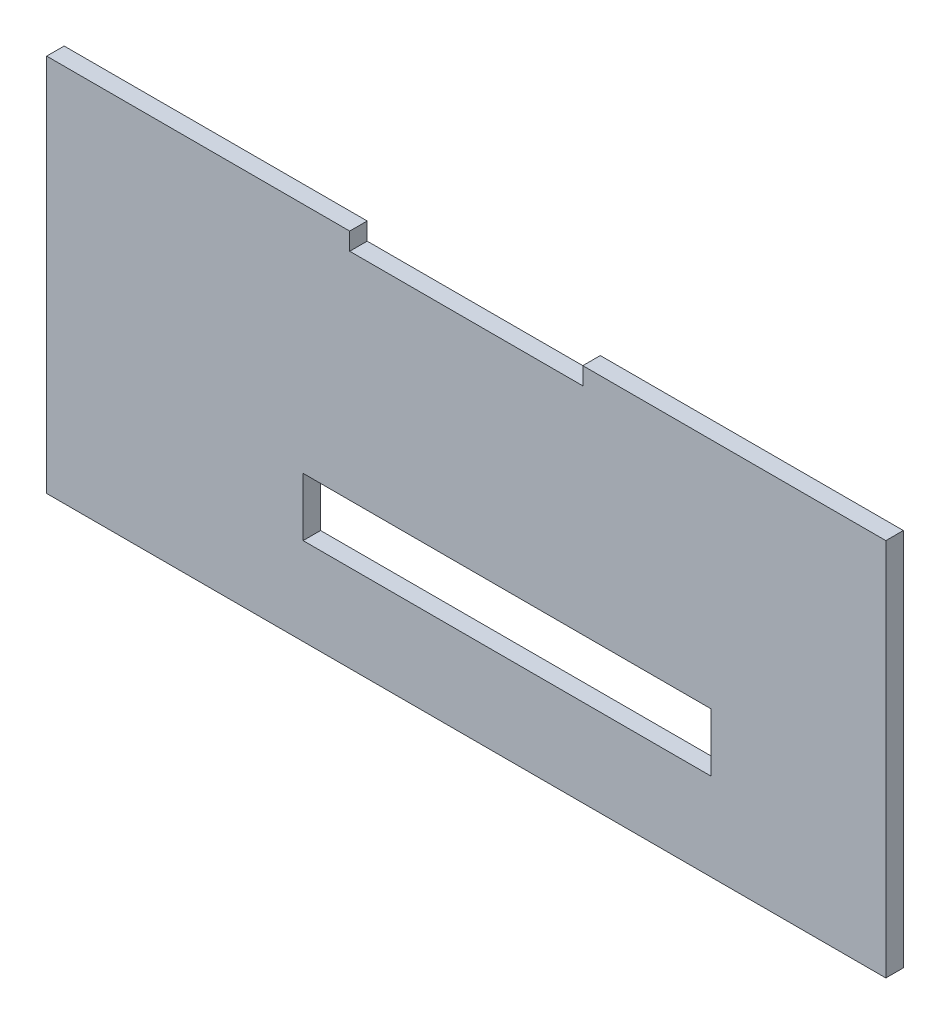
ISO-10303-21;
HEADER;
FILE_DESCRIPTION(('STEP AP214'),'2;1');
FILE_NAME('part.step','',(''),(''),'','','');
FILE_SCHEMA(('AUTOMOTIVE_DESIGN { 1 0 10303 214 1 1 1 1 }'));
ENDSEC;
DATA;
#1=APPLICATION_CONTEXT('core data for automotive mechanical design processes');
#2=APPLICATION_PROTOCOL_DEFINITION('international standard','automotive_design',2000,#1);
#3=PRODUCT_CONTEXT('',#1,'mechanical');
#4=PRODUCT('Part','Part','',(#3));
#5=PRODUCT_RELATED_PRODUCT_CATEGORY('part','',(#4));
#6=PRODUCT_DEFINITION_FORMATION('','',#4);
#7=PRODUCT_DEFINITION_CONTEXT('part definition',#1,'design');
#8=PRODUCT_DEFINITION('design','',#6,#7);
#9=PRODUCT_DEFINITION_SHAPE('','',#8);
#10=(LENGTH_UNIT() NAMED_UNIT(*) SI_UNIT(.MILLI.,.METRE.));
#11=(NAMED_UNIT(*) PLANE_ANGLE_UNIT() SI_UNIT($,.RADIAN.));
#12=(NAMED_UNIT(*) SI_UNIT($,.STERADIAN.) SOLID_ANGLE_UNIT());
#13=UNCERTAINTY_MEASURE_WITH_UNIT(LENGTH_MEASURE(1.E-05),#10,'distance_accuracy_value','');
#14=(GEOMETRIC_REPRESENTATION_CONTEXT(3) GLOBAL_UNCERTAINTY_ASSIGNED_CONTEXT((#13)) GLOBAL_UNIT_ASSIGNED_CONTEXT((#10,
#11,#12)) REPRESENTATION_CONTEXT('',''));
#15=CARTESIAN_POINT('',(0.,0.,0.));
#16=DIRECTION('',(0.,0.,1.));
#17=DIRECTION('',(1.,0.,0.));
#18=AXIS2_PLACEMENT_3D('',#15,#16,#17);
#19=CARTESIAN_POINT('',(0.,37.2829010171101,1.));
#20=DIRECTION('',(0.,1.,0.));
#21=DIRECTION('',(0.,0.,1.));
#22=AXIS2_PLACEMENT_3D('',#19,#20,#21);
#23=PLANE('',#22);
#24=DIRECTION('',(0.,0.,-1.));
#25=VECTOR('',#24,1.);
#26=CARTESIAN_POINT('',(23.7135698266103,37.2829010171101,1.));
#27=LINE('',#26,#25);
#28=CARTESIAN_POINT('',(23.7135698266103,37.2829010171101,1.));
#29=VERTEX_POINT('',#28);
#30=CARTESIAN_POINT('',(23.7135698266103,37.2829010171101,-2.));
#31=VERTEX_POINT('',#30);
#32=EDGE_CURVE('E57',#29,#31,#27,.T.);
#33=ORIENTED_EDGE('',*,*,#32,.T.);
#34=DIRECTION('',(1.,0.,0.));
#35=VECTOR('',#34,1.);
#36=CARTESIAN_POINT('',(0.,37.2829010171101,-2.));
#37=LINE('',#36,#35);
#38=CARTESIAN_POINT('',(-28.2864301733897,37.2829010171101,-2.));
#39=VERTEX_POINT('',#38);
#40=EDGE_CURVE('E164',#39,#31,#37,.T.);
#41=ORIENTED_EDGE('',*,*,#40,.F.);
#42=DIRECTION('',(0.,0.,-1.));
#43=VECTOR('',#42,1.);
#44=CARTESIAN_POINT('',(-28.2864301733897,37.2829010171101,1.));
#45=LINE('',#44,#43);
#46=CARTESIAN_POINT('',(-28.2864301733897,37.2829010171101,1.));
#47=VERTEX_POINT('',#46);
#48=EDGE_CURVE('E11',#47,#39,#45,.T.);
#49=ORIENTED_EDGE('',*,*,#48,.F.);
#50=DIRECTION('',(1.,0.,0.));
#51=VECTOR('',#50,1.);
#52=CARTESIAN_POINT('',(0.,37.2829010171101,1.));
#53=LINE('',#52,#51);
#54=EDGE_CURVE('E206',#47,#29,#53,.T.);
#55=ORIENTED_EDGE('',*,*,#54,.T.);
#56=EDGE_LOOP('',(#33,#41,#49,#55));
#57=FACE_BOUND('',#56,.T.);
#58=ADVANCED_FACE('F39',(#57),#23,.T.);
#59=CARTESIAN_POINT('',(-28.2864301733897,0.,1.));
#60=DIRECTION('',(1.,0.,0.));
#61=DIRECTION('',(0.,0.,-1.));
#62=AXIS2_PLACEMENT_3D('',#59,#60,#61);
#63=PLANE('',#62);
#64=ORIENTED_EDGE('',*,*,#48,.T.);
#65=DIRECTION('',(0.,-1.,0.));
#66=VECTOR('',#65,1.);
#67=CARTESIAN_POINT('',(-28.2864301733897,0.,-2.));
#68=LINE('',#67,#66);
#69=CARTESIAN_POINT('',(-28.2864301733897,34.2829010171101,-2.));
#70=VERTEX_POINT('',#69);
#71=EDGE_CURVE('E168',#39,#70,#68,.T.);
#72=ORIENTED_EDGE('',*,*,#71,.T.);
#73=DIRECTION('',(0.,0.,-1.));
#74=VECTOR('',#73,1.);
#75=CARTESIAN_POINT('',(-28.2864301733897,34.2829010171101,1.));
#76=LINE('',#75,#74);
#77=CARTESIAN_POINT('',(-28.2864301733897,34.2829010171101,1.));
#78=VERTEX_POINT('',#77);
#79=EDGE_CURVE('E49',#78,#70,#76,.T.);
#80=ORIENTED_EDGE('',*,*,#79,.F.);
#81=DIRECTION('',(0.,-1.,0.));
#82=VECTOR('',#81,1.);
#83=CARTESIAN_POINT('',(-28.2864301733897,0.,1.));
#84=LINE('',#83,#82);
#85=EDGE_CURVE('E209',#47,#78,#84,.T.);
#86=ORIENTED_EDGE('',*,*,#85,.F.);
#87=EDGE_LOOP('',(#64,#72,#80,#86));
#88=FACE_BOUND('',#87,.T.);
#89=ADVANCED_FACE('F272',(#88),#63,.F.);
#90=CARTESIAN_POINT('',(0.,34.2829010171101,1.));
#91=DIRECTION('',(0.,1.,0.));
#92=DIRECTION('',(0.,0.,1.));
#93=AXIS2_PLACEMENT_3D('',#90,#91,#92);
#94=PLANE('',#93);
#95=ORIENTED_EDGE('',*,*,#79,.T.);
#96=DIRECTION('',(1.,0.,0.));
#97=VECTOR('',#96,1.);
#98=CARTESIAN_POINT('',(0.,34.2829010171101,-2.));
#99=LINE('',#98,#97);
#100=CARTESIAN_POINT('',(-68.2864301733897,34.2829010171101,-2.));
#101=VERTEX_POINT('',#100);
#102=EDGE_CURVE('E173',#101,#70,#99,.T.);
#103=ORIENTED_EDGE('',*,*,#102,.F.);
#104=DIRECTION('',(0.,0.,-1.));
#105=VECTOR('',#104,1.);
#106=CARTESIAN_POINT('',(-68.2864301733897,34.2829010171101,1.));
#107=LINE('',#106,#105);
#108=CARTESIAN_POINT('',(-68.2864301733897,34.2829010171101,1.));
#109=VERTEX_POINT('',#108);
#110=EDGE_CURVE('E243',#109,#101,#107,.T.);
#111=ORIENTED_EDGE('',*,*,#110,.F.);
#112=DIRECTION('',(1.,0.,0.));
#113=VECTOR('',#112,1.);
#114=CARTESIAN_POINT('',(0.,34.2829010171101,1.));
#115=LINE('',#114,#113);
#116=EDGE_CURVE('E213',#109,#78,#115,.T.);
#117=ORIENTED_EDGE('',*,*,#116,.T.);
#118=EDGE_LOOP('',(#95,#103,#111,#117));
#119=FACE_BOUND('',#118,.T.);
#120=ADVANCED_FACE('F279',(#119),#94,.T.);
#121=CARTESIAN_POINT('',(-68.2864301733897,0.,1.));
#122=DIRECTION('',(1.,0.,0.));
#123=DIRECTION('',(0.,0.,-1.));
#124=AXIS2_PLACEMENT_3D('',#121,#122,#123);
#125=PLANE('',#124);
#126=ORIENTED_EDGE('',*,*,#110,.T.);
#127=DIRECTION('',(0.,-1.,0.));
#128=VECTOR('',#127,1.);
#129=CARTESIAN_POINT('',(-68.2864301733897,0.,-2.));
#130=LINE('',#129,#128);
#131=CARTESIAN_POINT('',(-68.2864301733897,37.2829010171101,-2.));
#132=VERTEX_POINT('',#131);
#133=EDGE_CURVE('E177',#132,#101,#130,.T.);
#134=ORIENTED_EDGE('',*,*,#133,.F.);
#135=DIRECTION('',(0.,0.,-1.));
#136=VECTOR('',#135,1.);
#137=CARTESIAN_POINT('',(-68.2864301733897,37.2829010171101,1.));
#138=LINE('',#137,#136);
#139=CARTESIAN_POINT('',(-68.2864301733897,37.2829010171101,1.));
#140=VERTEX_POINT('',#139);
#141=EDGE_CURVE('E240',#140,#132,#138,.T.);
#142=ORIENTED_EDGE('',*,*,#141,.F.);
#143=DIRECTION('',(0.,-1.,0.));
#144=VECTOR('',#143,1.);
#145=CARTESIAN_POINT('',(-68.2864301733897,0.,1.));
#146=LINE('',#145,#144);
#147=EDGE_CURVE('E217',#140,#109,#146,.T.);
#148=ORIENTED_EDGE('',*,*,#147,.T.);
#149=EDGE_LOOP('',(#126,#134,#142,#148));
#150=FACE_BOUND('',#149,.T.);
#151=ADVANCED_FACE('F285',(#150),#125,.T.);
#152=ORIENTED_EDGE('',*,*,#141,.T.);
#153=CARTESIAN_POINT('',(-120.28643017339,37.2829010171101,-2.));
#154=VERTEX_POINT('',#153);
#155=EDGE_CURVE('E169',#154,#132,#37,.T.);
#156=ORIENTED_EDGE('',*,*,#155,.F.);
#157=DIRECTION('',(0.,0.,-1.));
#158=VECTOR('',#157,1.);
#159=CARTESIAN_POINT('',(-120.28643017339,37.2829010171101,1.));
#160=LINE('',#159,#158);
#161=CARTESIAN_POINT('',(-120.28643017339,37.2829010171101,1.));
#162=VERTEX_POINT('',#161);
#163=EDGE_CURVE('E237',#162,#154,#160,.T.);
#164=ORIENTED_EDGE('',*,*,#163,.F.);
#165=EDGE_CURVE('E210',#162,#140,#53,.T.);
#166=ORIENTED_EDGE('',*,*,#165,.T.);
#167=EDGE_LOOP('',(#152,#156,#164,#166));
#168=FACE_BOUND('',#167,.T.);
#169=ADVANCED_FACE('F275',(#168),#23,.T.);
#170=CARTESIAN_POINT('',(-120.28643017339,0.,1.));
#171=DIRECTION('',(1.,0.,0.));
#172=DIRECTION('',(0.,0.,-1.));
#173=AXIS2_PLACEMENT_3D('',#170,#171,#172);
#174=PLANE('',#173);
#175=ORIENTED_EDGE('',*,*,#163,.T.);
#176=DIRECTION('',(0.,-1.,0.));
#177=VECTOR('',#176,1.);
#178=CARTESIAN_POINT('',(-120.28643017339,0.,-2.));
#179=LINE('',#178,#177);
#180=CARTESIAN_POINT('',(-120.28643017339,-27.7170989828899,-2.));
#181=VERTEX_POINT('',#180);
#182=EDGE_CURVE('E181',#154,#181,#179,.T.);
#183=ORIENTED_EDGE('',*,*,#182,.T.);
#184=DIRECTION('',(0.,0.,-1.));
#185=VECTOR('',#184,1.);
#186=CARTESIAN_POINT('',(-120.28643017339,-27.7170989828899,1.));
#187=LINE('',#186,#185);
#188=CARTESIAN_POINT('',(-120.28643017339,-27.7170989828899,1.));
#189=VERTEX_POINT('',#188);
#190=EDGE_CURVE('E234',#189,#181,#187,.T.);
#191=ORIENTED_EDGE('',*,*,#190,.F.);
#192=DIRECTION('',(0.,-1.,0.));
#193=VECTOR('',#192,1.);
#194=CARTESIAN_POINT('',(-120.28643017339,0.,1.));
#195=LINE('',#194,#193);
#196=EDGE_CURVE('E221',#162,#189,#195,.T.);
#197=ORIENTED_EDGE('',*,*,#196,.F.);
#198=EDGE_LOOP('',(#175,#183,#191,#197));
#199=FACE_BOUND('',#198,.T.);
#200=ADVANCED_FACE('F284',(#199),#174,.F.);
#201=CARTESIAN_POINT('',(0.,-27.7170989828899,1.));
#202=DIRECTION('',(0.,1.,0.));
#203=DIRECTION('',(0.,0.,1.));
#204=AXIS2_PLACEMENT_3D('',#201,#202,#203);
#205=PLANE('',#204);
#206=ORIENTED_EDGE('',*,*,#190,.T.);
#207=DIRECTION('',(1.,0.,0.));
#208=VECTOR('',#207,1.);
#209=CARTESIAN_POINT('',(0.,-27.7170989828899,-2.));
#210=LINE('',#209,#208);
#211=CARTESIAN_POINT('',(23.7135698266103,-27.7170989828899,-2.));
#212=VERTEX_POINT('',#211);
#213=EDGE_CURVE('E185',#181,#212,#210,.T.);
#214=ORIENTED_EDGE('',*,*,#213,.T.);
#215=DIRECTION('',(0.,0.,-1.));
#216=VECTOR('',#215,1.);
#217=CARTESIAN_POINT('',(23.7135698266103,-27.7170989828899,1.));
#218=LINE('',#217,#216);
#219=CARTESIAN_POINT('',(23.7135698266103,-27.7170989828899,1.));
#220=VERTEX_POINT('',#219);
#221=EDGE_CURVE('E231',#220,#212,#218,.T.);
#222=ORIENTED_EDGE('',*,*,#221,.F.);
#223=DIRECTION('',(1.,0.,0.));
#224=VECTOR('',#223,1.);
#225=CARTESIAN_POINT('',(0.,-27.7170989828899,1.));
#226=LINE('',#225,#224);
#227=EDGE_CURVE('E65',#189,#220,#226,.T.);
#228=ORIENTED_EDGE('',*,*,#227,.F.);
#229=EDGE_LOOP('',(#206,#214,#222,#228));
#230=FACE_BOUND('',#229,.T.);
#231=ADVANCED_FACE('F291',(#230),#205,.F.);
#232=CARTESIAN_POINT('',(0.,-2.71709898288988,1.));
#233=DIRECTION('',(0.,1.,0.));
#234=DIRECTION('',(0.,0.,1.));
#235=AXIS2_PLACEMENT_3D('',#232,#233,#234);
#236=PLANE('',#235);
#237=DIRECTION('',(0.,0.,-1.));
#238=VECTOR('',#237,1.);
#239=CARTESIAN_POINT('',(-76.2864301733897,-2.71709898288988,1.));
#240=LINE('',#239,#238);
#241=CARTESIAN_POINT('',(-76.2864301733897,-2.71709898288988,1.));
#242=VERTEX_POINT('',#241);
#243=CARTESIAN_POINT('',(-76.2864301733897,-2.71709898288988,-2.));
#244=VERTEX_POINT('',#243);
#245=EDGE_CURVE('E154',#242,#244,#240,.T.);
#246=ORIENTED_EDGE('',*,*,#245,.T.);
#247=DIRECTION('',(1.,0.,0.));
#248=VECTOR('',#247,1.);
#249=CARTESIAN_POINT('',(0.,-2.71709898288988,-2.));
#250=LINE('',#249,#248);
#251=CARTESIAN_POINT('',(-6.28643017338972,-2.71709898288988,-2.));
#252=VERTEX_POINT('',#251);
#253=EDGE_CURVE('E149',#244,#252,#250,.T.);
#254=ORIENTED_EDGE('',*,*,#253,.T.);
#255=DIRECTION('',(0.,0.,-1.));
#256=VECTOR('',#255,1.);
#257=CARTESIAN_POINT('',(-6.28643017338972,-2.71709898288988,1.));
#258=LINE('',#257,#256);
#259=CARTESIAN_POINT('',(-6.28643017338972,-2.71709898288988,1.));
#260=VERTEX_POINT('',#259);
#261=EDGE_CURVE('E43',#260,#252,#258,.T.);
#262=ORIENTED_EDGE('',*,*,#261,.F.);
#263=DIRECTION('',(1.,0.,0.));
#264=VECTOR('',#263,1.);
#265=CARTESIAN_POINT('',(0.,-2.71709898288988,1.));
#266=LINE('',#265,#264);
#267=EDGE_CURVE('E193',#242,#260,#266,.T.);
#268=ORIENTED_EDGE('',*,*,#267,.F.);
#269=EDGE_LOOP('',(#246,#254,#262,#268));
#270=FACE_BOUND('',#269,.T.);
#271=ADVANCED_FACE('F41',(#270),#236,.F.);
#272=CARTESIAN_POINT('',(-6.28643017338972,0.,1.));
#273=DIRECTION('',(1.,0.,0.));
#274=DIRECTION('',(0.,1.,0.));
#275=AXIS2_PLACEMENT_3D('',#272,#273,#274);
#276=PLANE('',#275);
#277=ORIENTED_EDGE('',*,*,#261,.T.);
#278=DIRECTION('',(0.,-1.,0.));
#279=VECTOR('',#278,1.);
#280=CARTESIAN_POINT('',(-6.28643017338972,0.,-2.));
#281=LINE('',#280,#279);
#282=CARTESIAN_POINT('',(-6.28643017338971,-12.7170989828899,-2.));
#283=VERTEX_POINT('',#282);
#284=EDGE_CURVE('E135',#252,#283,#281,.T.);
#285=ORIENTED_EDGE('',*,*,#284,.T.);
#286=DIRECTION('',(0.,0.,-1.));
#287=VECTOR('',#286,1.);
#288=CARTESIAN_POINT('',(-6.28643017338971,-12.7170989828899,1.));
#289=LINE('',#288,#287);
#290=CARTESIAN_POINT('',(-6.28643017338971,-12.7170989828899,1.));
#291=VERTEX_POINT('',#290);
#292=EDGE_CURVE('E142',#291,#283,#289,.T.);
#293=ORIENTED_EDGE('',*,*,#292,.F.);
#294=DIRECTION('',(0.,-1.,0.));
#295=VECTOR('',#294,1.);
#296=CARTESIAN_POINT('',(-6.28643017338972,0.,1.));
#297=LINE('',#296,#295);
#298=EDGE_CURVE('E136',#260,#291,#297,.T.);
#299=ORIENTED_EDGE('',*,*,#298,.F.);
#300=EDGE_LOOP('',(#277,#285,#293,#299));
#301=FACE_BOUND('',#300,.T.);
#302=ADVANCED_FACE('F133',(#301),#276,.F.);
#303=CARTESIAN_POINT('',(0.,-12.7170989828899,1.));
#304=DIRECTION('',(0.,1.,0.));
#305=DIRECTION('',(0.,0.,1.));
#306=AXIS2_PLACEMENT_3D('',#303,#304,#305);
#307=PLANE('',#306);
#308=ORIENTED_EDGE('',*,*,#292,.T.);
#309=DIRECTION('',(1.,0.,0.));
#310=VECTOR('',#309,1.);
#311=CARTESIAN_POINT('',(0.,-12.7170989828899,-2.));
#312=LINE('',#311,#310);
#313=CARTESIAN_POINT('',(-76.2864301733897,-12.7170989828899,-2.));
#314=VERTEX_POINT('',#313);
#315=EDGE_CURVE('E151',#314,#283,#312,.T.);
#316=ORIENTED_EDGE('',*,*,#315,.F.);
#317=DIRECTION('',(0.,0.,-1.));
#318=VECTOR('',#317,1.);
#319=CARTESIAN_POINT('',(-76.2864301733897,-12.7170989828899,1.));
#320=LINE('',#319,#318);
#321=CARTESIAN_POINT('',(-76.2864301733897,-12.7170989828899,1.));
#322=VERTEX_POINT('',#321);
#323=EDGE_CURVE('E250',#322,#314,#320,.T.);
#324=ORIENTED_EDGE('',*,*,#323,.F.);
#325=DIRECTION('',(1.,0.,0.));
#326=VECTOR('',#325,1.);
#327=CARTESIAN_POINT('',(0.,-12.7170989828899,1.));
#328=LINE('',#327,#326);
#329=EDGE_CURVE('E198',#322,#291,#328,.T.);
#330=ORIENTED_EDGE('',*,*,#329,.T.);
#331=EDGE_LOOP('',(#308,#316,#324,#330));
#332=FACE_BOUND('',#331,.T.);
#333=ADVANCED_FACE('F254',(#332),#307,.T.);
#334=CARTESIAN_POINT('',(-76.2864301733897,0.,1.));
#335=DIRECTION('',(1.,0.,0.));
#336=DIRECTION('',(0.,0.,-1.));
#337=AXIS2_PLACEMENT_3D('',#334,#335,#336);
#338=PLANE('',#337);
#339=ORIENTED_EDGE('',*,*,#323,.T.);
#340=DIRECTION('',(0.,-1.,0.));
#341=VECTOR('',#340,1.);
#342=CARTESIAN_POINT('',(-76.2864301733897,0.,-2.));
#343=LINE('',#342,#341);
#344=EDGE_CURVE('E161',#244,#314,#343,.T.);
#345=ORIENTED_EDGE('',*,*,#344,.F.);
#346=ORIENTED_EDGE('',*,*,#245,.F.);
#347=DIRECTION('',(0.,-1.,0.));
#348=VECTOR('',#347,1.);
#349=CARTESIAN_POINT('',(-76.2864301733897,0.,1.));
#350=LINE('',#349,#348);
#351=EDGE_CURVE('E202',#242,#322,#350,.T.);
#352=ORIENTED_EDGE('',*,*,#351,.T.);
#353=EDGE_LOOP('',(#339,#345,#346,#352));
#354=FACE_BOUND('',#353,.T.);
#355=ADVANCED_FACE('F260',(#354),#338,.T.);
#356=CARTESIAN_POINT('',(23.7135698266103,0.,1.));
#357=DIRECTION('',(1.,0.,0.));
#358=DIRECTION('',(0.,0.,-1.));
#359=AXIS2_PLACEMENT_3D('',#356,#357,#358);
#360=PLANE('',#359);
#361=ORIENTED_EDGE('',*,*,#221,.T.);
#362=DIRECTION('',(0.,-1.,0.));
#363=VECTOR('',#362,1.);
#364=CARTESIAN_POINT('',(23.7135698266103,0.,-2.));
#365=LINE('',#364,#363);
#366=EDGE_CURVE('E189',#31,#212,#365,.T.);
#367=ORIENTED_EDGE('',*,*,#366,.F.);
#368=ORIENTED_EDGE('',*,*,#32,.F.);
#369=DIRECTION('',(0.,-1.,0.));
#370=VECTOR('',#369,1.);
#371=CARTESIAN_POINT('',(23.7135698266103,0.,1.));
#372=LINE('',#371,#370);
#373=EDGE_CURVE('E226',#29,#220,#372,.T.);
#374=ORIENTED_EDGE('',*,*,#373,.T.);
#375=EDGE_LOOP('',(#361,#367,#368,#374));
#376=FACE_BOUND('',#375,.T.);
#377=ADVANCED_FACE('F262',(#376),#360,.T.);
#378=CARTESIAN_POINT('',(0.,0.,1.));
#379=DIRECTION('',(0.,0.,1.));
#380=DIRECTION('',(1.,0.,0.));
#381=AXIS2_PLACEMENT_3D('',#378,#379,#380);
#382=PLANE('',#381);
#383=ORIENTED_EDGE('',*,*,#267,.T.);
#384=ORIENTED_EDGE('',*,*,#298,.T.);
#385=ORIENTED_EDGE('',*,*,#329,.F.);
#386=ORIENTED_EDGE('',*,*,#351,.F.);
#387=EDGE_LOOP('',(#383,#384,#385,#386));
#388=FACE_BOUND('',#387,.T.);
#389=ORIENTED_EDGE('',*,*,#54,.F.);
#390=ORIENTED_EDGE('',*,*,#85,.T.);
#391=ORIENTED_EDGE('',*,*,#116,.F.);
#392=ORIENTED_EDGE('',*,*,#147,.F.);
#393=ORIENTED_EDGE('',*,*,#165,.F.);
#394=ORIENTED_EDGE('',*,*,#196,.T.);
#395=ORIENTED_EDGE('',*,*,#227,.T.);
#396=ORIENTED_EDGE('',*,*,#373,.F.);
#397=EDGE_LOOP('',(#389,#390,#391,#392,#393,#394,#395,#396));
#398=FACE_BOUND('',#397,.T.);
#399=ADVANCED_FACE('F258',(#388,#398),#382,.T.);
#400=CARTESIAN_POINT('',(0.,0.,-2.));
#401=DIRECTION('',(0.,0.,1.));
#402=DIRECTION('',(1.,0.,0.));
#403=AXIS2_PLACEMENT_3D('',#400,#401,#402);
#404=PLANE('',#403);
#405=ORIENTED_EDGE('',*,*,#253,.F.);
#406=ORIENTED_EDGE('',*,*,#344,.T.);
#407=ORIENTED_EDGE('',*,*,#315,.T.);
#408=ORIENTED_EDGE('',*,*,#284,.F.);
#409=EDGE_LOOP('',(#405,#406,#407,#408));
#410=FACE_BOUND('',#409,.T.);
#411=ORIENTED_EDGE('',*,*,#40,.T.);
#412=ORIENTED_EDGE('',*,*,#366,.T.);
#413=ORIENTED_EDGE('',*,*,#213,.F.);
#414=ORIENTED_EDGE('',*,*,#182,.F.);
#415=ORIENTED_EDGE('',*,*,#155,.T.);
#416=ORIENTED_EDGE('',*,*,#133,.T.);
#417=ORIENTED_EDGE('',*,*,#102,.T.);
#418=ORIENTED_EDGE('',*,*,#71,.F.);
#419=EDGE_LOOP('',(#411,#412,#413,#414,#415,#416,#417,#418));
#420=FACE_BOUND('',#419,.T.);
#421=ADVANCED_FACE('F146',(#410,#420),#404,.F.);
#422=CLOSED_SHELL('',(#58,#89,#120,#151,#169,#200,#231,#271,#302,#333,#355,#377,#399,#421));
#423=MANIFOLD_SOLID_BREP('B2',#422);
#424=ADVANCED_BREP_SHAPE_REPRESENTATION('',(#18,#423),#14);
#425=SHAPE_DEFINITION_REPRESENTATION(#9,#424);
ENDSEC;
END-ISO-10303-21;
